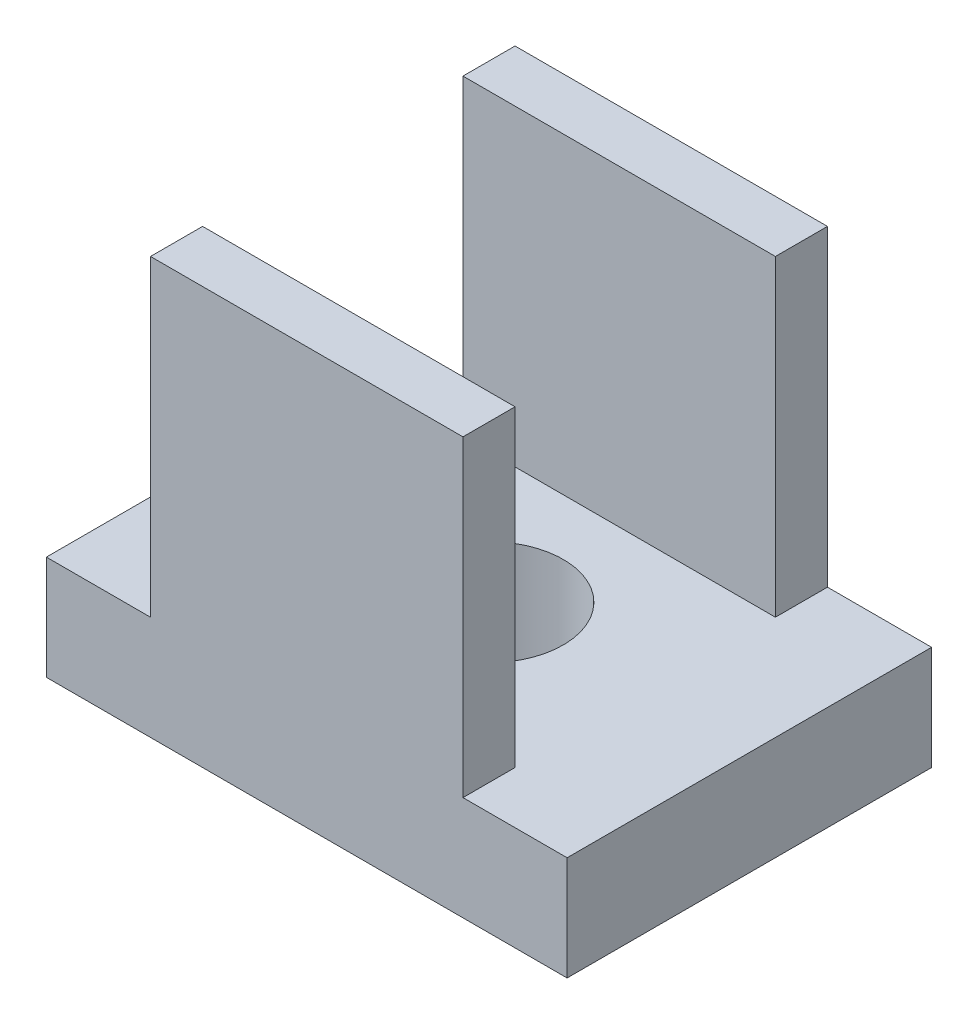
ISO-10303-21;
HEADER;
FILE_DESCRIPTION(('STEP AP214'),'2;1');
FILE_NAME('part.step','',(''),(''),'','','');
FILE_SCHEMA(('AUTOMOTIVE_DESIGN { 1 0 10303 214 1 1 1 1 }'));
ENDSEC;
DATA;
#1=APPLICATION_CONTEXT('core data for automotive mechanical design processes');
#2=APPLICATION_PROTOCOL_DEFINITION('international standard','automotive_design',2000,#1);
#3=PRODUCT_CONTEXT('',#1,'mechanical');
#4=PRODUCT('Part','Part','',(#3));
#5=PRODUCT_RELATED_PRODUCT_CATEGORY('part','',(#4));
#6=PRODUCT_DEFINITION_FORMATION('','',#4);
#7=PRODUCT_DEFINITION_CONTEXT('part definition',#1,'design');
#8=PRODUCT_DEFINITION('design','',#6,#7);
#9=PRODUCT_DEFINITION_SHAPE('','',#8);
#10=(LENGTH_UNIT() NAMED_UNIT(*) SI_UNIT(.MILLI.,.METRE.));
#11=(NAMED_UNIT(*) PLANE_ANGLE_UNIT() SI_UNIT($,.RADIAN.));
#12=(NAMED_UNIT(*) SI_UNIT($,.STERADIAN.) SOLID_ANGLE_UNIT());
#13=UNCERTAINTY_MEASURE_WITH_UNIT(LENGTH_MEASURE(1.E-05),#10,'distance_accuracy_value','');
#14=(GEOMETRIC_REPRESENTATION_CONTEXT(3) GLOBAL_UNCERTAINTY_ASSIGNED_CONTEXT((#13)) GLOBAL_UNIT_ASSIGNED_CONTEXT((#10,
#11,#12)) REPRESENTATION_CONTEXT('',''));
#15=CARTESIAN_POINT('',(0.,0.,0.));
#16=DIRECTION('',(0.,0.,1.));
#17=DIRECTION('',(1.,0.,0.));
#18=AXIS2_PLACEMENT_3D('',#15,#16,#17);
#19=CARTESIAN_POINT('',(-5.,2.,3.5));
#20=DIRECTION('',(1.,0.,0.));
#21=DIRECTION('',(0.,0.,-1.));
#22=AXIS2_PLACEMENT_3D('',#19,#20,#21);
#23=PLANE('',#22);
#24=DIRECTION('',(0.,0.,1.));
#25=VECTOR('',#24,1.);
#26=CARTESIAN_POINT('',(-5.,0.,3.5));
#27=LINE('',#26,#25);
#28=CARTESIAN_POINT('',(-5.,0.,-3.5));
#29=VERTEX_POINT('',#28);
#30=CARTESIAN_POINT('',(-5.,0.,3.5));
#31=VERTEX_POINT('',#30);
#32=EDGE_CURVE('E221',#29,#31,#27,.T.);
#33=ORIENTED_EDGE('',*,*,#32,.T.);
#34=DIRECTION('',(0.,-1.,0.));
#35=VECTOR('',#34,1.);
#36=CARTESIAN_POINT('',(-5.,2.,3.5));
#37=LINE('',#36,#35);
#38=CARTESIAN_POINT('',(-5.,2.,3.5));
#39=VERTEX_POINT('',#38);
#40=EDGE_CURVE('E11',#39,#31,#37,.T.);
#41=ORIENTED_EDGE('',*,*,#40,.F.);
#42=DIRECTION('',(0.,0.,1.));
#43=VECTOR('',#42,1.);
#44=CARTESIAN_POINT('',(-5.,2.,3.5));
#45=LINE('',#44,#43);
#46=CARTESIAN_POINT('',(-5.,2.,-3.5));
#47=VERTEX_POINT('',#46);
#48=EDGE_CURVE('E225',#47,#39,#45,.T.);
#49=ORIENTED_EDGE('',*,*,#48,.F.);
#50=DIRECTION('',(0.,-1.,0.));
#51=VECTOR('',#50,1.);
#52=CARTESIAN_POINT('',(-5.,2.,-3.5));
#53=LINE('',#52,#51);
#54=EDGE_CURVE('E241',#47,#29,#53,.T.);
#55=ORIENTED_EDGE('',*,*,#54,.T.);
#56=EDGE_LOOP('',(#33,#41,#49,#55));
#57=FACE_BOUND('',#56,.T.);
#58=ADVANCED_FACE('F39',(#57),#23,.F.);
#59=CARTESIAN_POINT('',(5.,2.,3.5));
#60=DIRECTION('',(0.,0.,-1.));
#61=DIRECTION('',(-1.,0.,0.));
#62=AXIS2_PLACEMENT_3D('',#59,#60,#61);
#63=PLANE('',#62);
#64=DIRECTION('',(1.,0.,0.));
#65=VECTOR('',#64,1.);
#66=CARTESIAN_POINT('',(5.,0.,3.5));
#67=LINE('',#66,#65);
#68=CARTESIAN_POINT('',(5.,0.,3.5));
#69=VERTEX_POINT('',#68);
#70=EDGE_CURVE('E245',#31,#69,#67,.T.);
#71=ORIENTED_EDGE('',*,*,#70,.T.);
#72=DIRECTION('',(0.,-1.,0.));
#73=VECTOR('',#72,1.);
#74=CARTESIAN_POINT('',(5.,2.,3.5));
#75=LINE('',#74,#73);
#76=CARTESIAN_POINT('',(5.,2.,3.5));
#77=VERTEX_POINT('',#76);
#78=EDGE_CURVE('E47',#77,#69,#75,.T.);
#79=ORIENTED_EDGE('',*,*,#78,.F.);
#80=DIRECTION('',(1.,0.,0.));
#81=VECTOR('',#80,1.);
#82=CARTESIAN_POINT('',(5.,2.,3.5));
#83=LINE('',#82,#81);
#84=CARTESIAN_POINT('',(3.,2.,3.5));
#85=VERTEX_POINT('',#84);
#86=EDGE_CURVE('E229',#85,#77,#83,.T.);
#87=ORIENTED_EDGE('',*,*,#86,.F.);
#88=DIRECTION('',(0.,-1.,0.));
#89=VECTOR('',#88,1.);
#90=CARTESIAN_POINT('',(3.,8.,3.5));
#91=LINE('',#90,#89);
#92=CARTESIAN_POINT('',(3.,8.,3.5));
#93=VERTEX_POINT('',#92);
#94=EDGE_CURVE('E190',#93,#85,#91,.T.);
#95=ORIENTED_EDGE('',*,*,#94,.F.);
#96=DIRECTION('',(1.,0.,0.));
#97=VECTOR('',#96,1.);
#98=CARTESIAN_POINT('',(3.,8.,3.5));
#99=LINE('',#98,#97);
#100=CARTESIAN_POINT('',(-3.,8.,3.5));
#101=VERTEX_POINT('',#100);
#102=EDGE_CURVE('E187',#101,#93,#99,.T.);
#103=ORIENTED_EDGE('',*,*,#102,.F.);
#104=DIRECTION('',(0.,-1.,0.));
#105=VECTOR('',#104,1.);
#106=CARTESIAN_POINT('',(-3.,8.,3.5));
#107=LINE('',#106,#105);
#108=CARTESIAN_POINT('',(-3.,2.,3.5));
#109=VERTEX_POINT('',#108);
#110=EDGE_CURVE('E204',#101,#109,#107,.T.);
#111=ORIENTED_EDGE('',*,*,#110,.T.);
#112=EDGE_CURVE('E231',#39,#109,#83,.T.);
#113=ORIENTED_EDGE('',*,*,#112,.F.);
#114=ORIENTED_EDGE('',*,*,#40,.T.);
#115=EDGE_LOOP('',(#71,#79,#87,#95,#103,#111,#113,#114));
#116=FACE_BOUND('',#115,.T.);
#117=ADVANCED_FACE('F282',(#116),#63,.F.);
#118=CARTESIAN_POINT('',(5.,2.,3.5));
#119=DIRECTION('',(-1.,0.,0.));
#120=DIRECTION('',(0.,0.,1.));
#121=AXIS2_PLACEMENT_3D('',#118,#119,#120);
#122=PLANE('',#121);
#123=DIRECTION('',(0.,0.,-1.));
#124=VECTOR('',#123,1.);
#125=CARTESIAN_POINT('',(5.,0.,3.5));
#126=LINE('',#125,#124);
#127=CARTESIAN_POINT('',(5.,0.,-3.5));
#128=VERTEX_POINT('',#127);
#129=EDGE_CURVE('E248',#69,#128,#126,.T.);
#130=ORIENTED_EDGE('',*,*,#129,.T.);
#131=DIRECTION('',(0.,-1.,0.));
#132=VECTOR('',#131,1.);
#133=CARTESIAN_POINT('',(5.,2.,-3.5));
#134=LINE('',#133,#132);
#135=CARTESIAN_POINT('',(5.,2.,-3.5));
#136=VERTEX_POINT('',#135);
#137=EDGE_CURVE('E256',#136,#128,#134,.T.);
#138=ORIENTED_EDGE('',*,*,#137,.F.);
#139=DIRECTION('',(0.,0.,-1.));
#140=VECTOR('',#139,1.);
#141=CARTESIAN_POINT('',(5.,2.,3.5));
#142=LINE('',#141,#140);
#143=EDGE_CURVE('E234',#77,#136,#142,.T.);
#144=ORIENTED_EDGE('',*,*,#143,.F.);
#145=ORIENTED_EDGE('',*,*,#78,.T.);
#146=EDGE_LOOP('',(#130,#138,#144,#145));
#147=FACE_BOUND('',#146,.T.);
#148=ADVANCED_FACE('F265',(#147),#122,.F.);
#149=CARTESIAN_POINT('',(5.,2.,-3.5));
#150=DIRECTION('',(0.,0.,1.));
#151=DIRECTION('',(1.,0.,0.));
#152=AXIS2_PLACEMENT_3D('',#149,#150,#151);
#153=PLANE('',#152);
#154=DIRECTION('',(-1.,0.,0.));
#155=VECTOR('',#154,1.);
#156=CARTESIAN_POINT('',(5.,0.,-3.5));
#157=LINE('',#156,#155);
#158=EDGE_CURVE('E230',#128,#29,#157,.T.);
#159=ORIENTED_EDGE('',*,*,#158,.T.);
#160=ORIENTED_EDGE('',*,*,#54,.F.);
#161=DIRECTION('',(-1.,0.,0.));
#162=VECTOR('',#161,1.);
#163=CARTESIAN_POINT('',(5.,2.,-3.5));
#164=LINE('',#163,#162);
#165=CARTESIAN_POINT('',(-3.,2.,-3.5));
#166=VERTEX_POINT('',#165);
#167=EDGE_CURVE('E237',#166,#47,#164,.T.);
#168=ORIENTED_EDGE('',*,*,#167,.F.);
#169=DIRECTION('',(0.,-1.,0.));
#170=VECTOR('',#169,1.);
#171=CARTESIAN_POINT('',(-3.,8.,-3.5));
#172=LINE('',#171,#170);
#173=CARTESIAN_POINT('',(-3.,8.,-3.5));
#174=VERTEX_POINT('',#173);
#175=EDGE_CURVE('E140',#174,#166,#172,.T.);
#176=ORIENTED_EDGE('',*,*,#175,.F.);
#177=DIRECTION('',(1.,0.,0.));
#178=VECTOR('',#177,1.);
#179=CARTESIAN_POINT('',(3.,8.,-3.5));
#180=LINE('',#179,#178);
#181=CARTESIAN_POINT('',(3.,8.,-3.5));
#182=VERTEX_POINT('',#181);
#183=EDGE_CURVE('E146',#174,#182,#180,.T.);
#184=ORIENTED_EDGE('',*,*,#183,.T.);
#185=DIRECTION('',(0.,-1.,0.));
#186=VECTOR('',#185,1.);
#187=CARTESIAN_POINT('',(3.,8.,-3.5));
#188=LINE('',#187,#186);
#189=CARTESIAN_POINT('',(3.,2.,-3.5));
#190=VERTEX_POINT('',#189);
#191=EDGE_CURVE('E128',#182,#190,#188,.T.);
#192=ORIENTED_EDGE('',*,*,#191,.T.);
#193=EDGE_CURVE('E238',#136,#190,#164,.T.);
#194=ORIENTED_EDGE('',*,*,#193,.F.);
#195=ORIENTED_EDGE('',*,*,#137,.T.);
#196=EDGE_LOOP('',(#159,#160,#168,#176,#184,#192,#194,#195));
#197=FACE_BOUND('',#196,.T.);
#198=ADVANCED_FACE('F152',(#197),#153,.F.);
#199=CARTESIAN_POINT('',(0.,2.,0.));
#200=DIRECTION('',(0.,1.,0.));
#201=DIRECTION('',(0.,0.,1.));
#202=AXIS2_PLACEMENT_3D('',#199,#200,#201);
#203=PLANE('',#202);
#204=DIRECTION('',(0.,0.,1.));
#205=VECTOR('',#204,1.);
#206=CARTESIAN_POINT('',(3.,2.,-3.5));
#207=LINE('',#206,#205);
#208=CARTESIAN_POINT('',(3.,2.,-2.5));
#209=VERTEX_POINT('',#208);
#210=EDGE_CURVE('E134',#190,#209,#207,.T.);
#211=ORIENTED_EDGE('',*,*,#210,.T.);
#212=DIRECTION('',(-1.,0.,0.));
#213=VECTOR('',#212,1.);
#214=CARTESIAN_POINT('',(3.,2.,-2.5));
#215=LINE('',#214,#213);
#216=CARTESIAN_POINT('',(-3.,2.,-2.5));
#217=VERTEX_POINT('',#216);
#218=EDGE_CURVE('E54',#209,#217,#215,.T.);
#219=ORIENTED_EDGE('',*,*,#218,.T.);
#220=DIRECTION('',(0.,0.,-1.));
#221=VECTOR('',#220,1.);
#222=CARTESIAN_POINT('',(-3.,2.,-3.5));
#223=LINE('',#222,#221);
#224=EDGE_CURVE('E59',#217,#166,#223,.T.);
#225=ORIENTED_EDGE('',*,*,#224,.T.);
#226=ORIENTED_EDGE('',*,*,#167,.T.);
#227=ORIENTED_EDGE('',*,*,#48,.T.);
#228=ORIENTED_EDGE('',*,*,#112,.T.);
#229=DIRECTION('',(0.,0.,1.));
#230=VECTOR('',#229,1.);
#231=CARTESIAN_POINT('',(-3.,2.,3.5));
#232=LINE('',#231,#230);
#233=CARTESIAN_POINT('',(-3.,2.,2.5));
#234=VERTEX_POINT('',#233);
#235=EDGE_CURVE('E181',#234,#109,#232,.T.);
#236=ORIENTED_EDGE('',*,*,#235,.F.);
#237=DIRECTION('',(-1.,0.,0.));
#238=VECTOR('',#237,1.);
#239=CARTESIAN_POINT('',(3.,2.,2.5));
#240=LINE('',#239,#238);
#241=CARTESIAN_POINT('',(3.,2.,2.5));
#242=VERTEX_POINT('',#241);
#243=EDGE_CURVE('E194',#242,#234,#240,.T.);
#244=ORIENTED_EDGE('',*,*,#243,.F.);
#245=DIRECTION('',(0.,0.,-1.));
#246=VECTOR('',#245,1.);
#247=CARTESIAN_POINT('',(3.,2.,3.5));
#248=LINE('',#247,#246);
#249=EDGE_CURVE('E139',#85,#242,#248,.T.);
#250=ORIENTED_EDGE('',*,*,#249,.F.);
#251=ORIENTED_EDGE('',*,*,#86,.T.);
#252=ORIENTED_EDGE('',*,*,#143,.T.);
#253=ORIENTED_EDGE('',*,*,#193,.T.);
#254=EDGE_LOOP('',(#211,#219,#225,#226,#227,#228,#236,#244,#250,#251,#252,#253));
#255=FACE_BOUND('',#254,.T.);
#256=CARTESIAN_POINT('',(0.,2.,0.));
#257=DIRECTION('',(0.,1.,0.));
#258=DIRECTION('',(0.,0.,1.));
#259=AXIS2_PLACEMENT_3D('',#256,#257,#258);
#260=CIRCLE('',#259,1.425);
#261=CARTESIAN_POINT('',(0.,2.,1.425));
#262=VERTEX_POINT('',#261);
#263=EDGE_CURVE('E216',#262,#262,#260,.T.);
#264=ORIENTED_EDGE('',*,*,#263,.F.);
#265=EDGE_LOOP('',(#264));
#266=FACE_BOUND('',#265,.T.);
#267=ADVANCED_FACE('F277',(#255,#266),#203,.T.);
#268=CARTESIAN_POINT('',(0.,0.,0.));
#269=DIRECTION('',(0.,1.,0.));
#270=DIRECTION('',(0.,0.,1.));
#271=AXIS2_PLACEMENT_3D('',#268,#269,#270);
#272=PLANE('',#271);
#273=CARTESIAN_POINT('',(0.,0.,0.));
#274=DIRECTION('',(0.,1.,0.));
#275=DIRECTION('',(0.,0.,1.));
#276=AXIS2_PLACEMENT_3D('',#273,#274,#275);
#277=CIRCLE('',#276,1.425);
#278=CARTESIAN_POINT('',(0.,0.,1.425));
#279=VERTEX_POINT('',#278);
#280=EDGE_CURVE('E217',#279,#279,#277,.T.);
#281=ORIENTED_EDGE('',*,*,#280,.T.);
#282=EDGE_LOOP('',(#281));
#283=FACE_BOUND('',#282,.T.);
#284=ORIENTED_EDGE('',*,*,#32,.F.);
#285=ORIENTED_EDGE('',*,*,#158,.F.);
#286=ORIENTED_EDGE('',*,*,#129,.F.);
#287=ORIENTED_EDGE('',*,*,#70,.F.);
#288=EDGE_LOOP('',(#284,#285,#286,#287));
#289=FACE_BOUND('',#288,.T.);
#290=ADVANCED_FACE('F272',(#283,#289),#272,.F.);
#291=CARTESIAN_POINT('',(0.,0.,0.));
#292=DIRECTION('',(0.,1.,0.));
#293=DIRECTION('',(0.,0.,1.));
#294=AXIS2_PLACEMENT_3D('',#291,#292,#293);
#295=CYLINDRICAL_SURFACE('',#294,1.425);
#296=ORIENTED_EDGE('',*,*,#280,.F.);
#297=EDGE_LOOP('',(#296));
#298=FACE_BOUND('',#297,.T.);
#299=ORIENTED_EDGE('',*,*,#263,.T.);
#300=EDGE_LOOP('',(#299));
#301=FACE_BOUND('',#300,.T.);
#302=ADVANCED_FACE('F304',(#298,#301),#295,.F.);
#303=CARTESIAN_POINT('',(3.,8.,3.5));
#304=DIRECTION('',(-1.,0.,0.));
#305=DIRECTION('',(0.,0.,1.));
#306=AXIS2_PLACEMENT_3D('',#303,#304,#305);
#307=PLANE('',#306);
#308=ORIENTED_EDGE('',*,*,#249,.T.);
#309=DIRECTION('',(0.,-1.,0.));
#310=VECTOR('',#309,1.);
#311=CARTESIAN_POINT('',(3.,8.,2.5));
#312=LINE('',#311,#310);
#313=CARTESIAN_POINT('',(3.,8.,2.5));
#314=VERTEX_POINT('',#313);
#315=EDGE_CURVE('E212',#314,#242,#312,.T.);
#316=ORIENTED_EDGE('',*,*,#315,.F.);
#317=DIRECTION('',(0.,0.,-1.));
#318=VECTOR('',#317,1.);
#319=CARTESIAN_POINT('',(3.,8.,3.5));
#320=LINE('',#319,#318);
#321=EDGE_CURVE('E176',#93,#314,#320,.T.);
#322=ORIENTED_EDGE('',*,*,#321,.F.);
#323=ORIENTED_EDGE('',*,*,#94,.T.);
#324=EDGE_LOOP('',(#308,#316,#322,#323));
#325=FACE_BOUND('',#324,.T.);
#326=ADVANCED_FACE('F286',(#325),#307,.F.);
#327=CARTESIAN_POINT('',(3.,8.,2.5));
#328=DIRECTION('',(0.,0.,1.));
#329=DIRECTION('',(1.,0.,0.));
#330=AXIS2_PLACEMENT_3D('',#327,#328,#329);
#331=PLANE('',#330);
#332=ORIENTED_EDGE('',*,*,#243,.T.);
#333=DIRECTION('',(0.,-1.,0.));
#334=VECTOR('',#333,1.);
#335=CARTESIAN_POINT('',(-3.,8.,2.5));
#336=LINE('',#335,#334);
#337=CARTESIAN_POINT('',(-3.,8.,2.5));
#338=VERTEX_POINT('',#337);
#339=EDGE_CURVE('E208',#338,#234,#336,.T.);
#340=ORIENTED_EDGE('',*,*,#339,.F.);
#341=DIRECTION('',(-1.,0.,0.));
#342=VECTOR('',#341,1.);
#343=CARTESIAN_POINT('',(3.,8.,2.5));
#344=LINE('',#343,#342);
#345=EDGE_CURVE('E180',#314,#338,#344,.T.);
#346=ORIENTED_EDGE('',*,*,#345,.F.);
#347=ORIENTED_EDGE('',*,*,#315,.T.);
#348=EDGE_LOOP('',(#332,#340,#346,#347));
#349=FACE_BOUND('',#348,.T.);
#350=ADVANCED_FACE('F296',(#349),#331,.F.);
#351=CARTESIAN_POINT('',(-3.,8.,3.5));
#352=DIRECTION('',(1.,0.,0.));
#353=DIRECTION('',(0.,0.,-1.));
#354=AXIS2_PLACEMENT_3D('',#351,#352,#353);
#355=PLANE('',#354);
#356=ORIENTED_EDGE('',*,*,#235,.T.);
#357=ORIENTED_EDGE('',*,*,#110,.F.);
#358=DIRECTION('',(0.,0.,1.));
#359=VECTOR('',#358,1.);
#360=CARTESIAN_POINT('',(-3.,8.,3.5));
#361=LINE('',#360,#359);
#362=EDGE_CURVE('E184',#338,#101,#361,.T.);
#363=ORIENTED_EDGE('',*,*,#362,.F.);
#364=ORIENTED_EDGE('',*,*,#339,.T.);
#365=EDGE_LOOP('',(#356,#357,#363,#364));
#366=FACE_BOUND('',#365,.T.);
#367=ADVANCED_FACE('F294',(#366),#355,.F.);
#368=CARTESIAN_POINT('',(0.,8.,0.));
#369=DIRECTION('',(0.,1.,0.));
#370=DIRECTION('',(0.,0.,1.));
#371=AXIS2_PLACEMENT_3D('',#368,#369,#370);
#372=PLANE('',#371);
#373=ORIENTED_EDGE('',*,*,#321,.T.);
#374=ORIENTED_EDGE('',*,*,#345,.T.);
#375=ORIENTED_EDGE('',*,*,#362,.T.);
#376=ORIENTED_EDGE('',*,*,#102,.T.);
#377=EDGE_LOOP('',(#373,#374,#375,#376));
#378=FACE_BOUND('',#377,.T.);
#379=ADVANCED_FACE('F289',(#378),#372,.T.);
#380=CARTESIAN_POINT('',(3.,8.,-3.5));
#381=DIRECTION('',(1.,0.,0.));
#382=DIRECTION('',(0.,0.,-1.));
#383=AXIS2_PLACEMENT_3D('',#380,#381,#382);
#384=PLANE('',#383);
#385=ORIENTED_EDGE('',*,*,#210,.F.);
#386=ORIENTED_EDGE('',*,*,#191,.F.);
#387=DIRECTION('',(0.,0.,1.));
#388=VECTOR('',#387,1.);
#389=CARTESIAN_POINT('',(3.,8.,-3.5));
#390=LINE('',#389,#388);
#391=CARTESIAN_POINT('',(3.,8.,-2.5));
#392=VERTEX_POINT('',#391);
#393=EDGE_CURVE('E132',#182,#392,#390,.T.);
#394=ORIENTED_EDGE('',*,*,#393,.T.);
#395=DIRECTION('',(0.,-1.,0.));
#396=VECTOR('',#395,1.);
#397=CARTESIAN_POINT('',(3.,8.,-2.5));
#398=LINE('',#397,#396);
#399=EDGE_CURVE('E162',#392,#209,#398,.T.);
#400=ORIENTED_EDGE('',*,*,#399,.T.);
#401=EDGE_LOOP('',(#385,#386,#394,#400));
#402=FACE_BOUND('',#401,.T.);
#403=ADVANCED_FACE('F130',(#402),#384,.T.);
#404=CARTESIAN_POINT('',(-3.,8.,-3.5));
#405=DIRECTION('',(-1.,0.,0.));
#406=DIRECTION('',(0.,0.,1.));
#407=AXIS2_PLACEMENT_3D('',#404,#405,#406);
#408=PLANE('',#407);
#409=ORIENTED_EDGE('',*,*,#224,.F.);
#410=DIRECTION('',(0.,-1.,0.));
#411=VECTOR('',#410,1.);
#412=CARTESIAN_POINT('',(-3.,8.,-2.5));
#413=LINE('',#412,#411);
#414=CARTESIAN_POINT('',(-3.,8.,-2.5));
#415=VERTEX_POINT('',#414);
#416=EDGE_CURVE('E171',#415,#217,#413,.T.);
#417=ORIENTED_EDGE('',*,*,#416,.F.);
#418=DIRECTION('',(0.,0.,-1.));
#419=VECTOR('',#418,1.);
#420=CARTESIAN_POINT('',(-3.,8.,-3.5));
#421=LINE('',#420,#419);
#422=EDGE_CURVE('E155',#415,#174,#421,.T.);
#423=ORIENTED_EDGE('',*,*,#422,.T.);
#424=ORIENTED_EDGE('',*,*,#175,.T.);
#425=EDGE_LOOP('',(#409,#417,#423,#424));
#426=FACE_BOUND('',#425,.T.);
#427=ADVANCED_FACE('F378',(#426),#408,.T.);
#428=CARTESIAN_POINT('',(3.,8.,-2.5));
#429=DIRECTION('',(0.,0.,1.));
#430=DIRECTION('',(1.,0.,0.));
#431=AXIS2_PLACEMENT_3D('',#428,#429,#430);
#432=PLANE('',#431);
#433=ORIENTED_EDGE('',*,*,#218,.F.);
#434=ORIENTED_EDGE('',*,*,#399,.F.);
#435=DIRECTION('',(-1.,0.,0.));
#436=VECTOR('',#435,1.);
#437=CARTESIAN_POINT('',(3.,8.,-2.5));
#438=LINE('',#437,#436);
#439=EDGE_CURVE('E149',#392,#415,#438,.T.);
#440=ORIENTED_EDGE('',*,*,#439,.T.);
#441=ORIENTED_EDGE('',*,*,#416,.T.);
#442=EDGE_LOOP('',(#433,#434,#440,#441));
#443=FACE_BOUND('',#442,.T.);
#444=ADVANCED_FACE('F387',(#443),#432,.T.);
#445=CARTESIAN_POINT('',(0.,8.,0.));
#446=DIRECTION('',(0.,1.,0.));
#447=DIRECTION('',(0.,0.,-1.));
#448=AXIS2_PLACEMENT_3D('',#445,#446,#447);
#449=PLANE('',#448);
#450=ORIENTED_EDGE('',*,*,#393,.F.);
#451=ORIENTED_EDGE('',*,*,#183,.F.);
#452=ORIENTED_EDGE('',*,*,#422,.F.);
#453=ORIENTED_EDGE('',*,*,#439,.F.);
#454=EDGE_LOOP('',(#450,#451,#452,#453));
#455=FACE_BOUND('',#454,.T.);
#456=ADVANCED_FACE('F144',(#455),#449,.T.);
#457=CLOSED_SHELL('',(#58,#117,#148,#198,#267,#290,#302,#326,#350,#367,#379,#403,#427,#444,#456));
#458=MANIFOLD_SOLID_BREP('B2',#457);
#459=ADVANCED_BREP_SHAPE_REPRESENTATION('',(#18,#458),#14);
#460=SHAPE_DEFINITION_REPRESENTATION(#9,#459);
ENDSEC;
END-ISO-10303-21;
